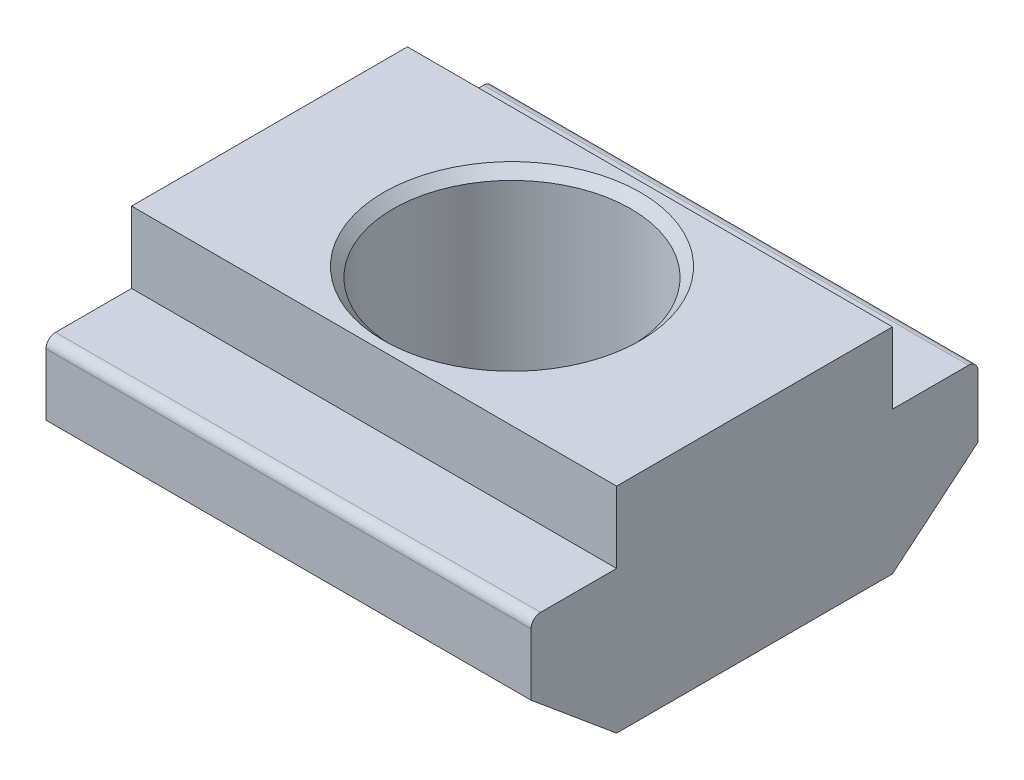
ISO-10303-21;
HEADER;
FILE_DESCRIPTION(('STEP AP214'),'2;1');
FILE_NAME('part.step','',(''),(''),'','','');
FILE_SCHEMA(('AUTOMOTIVE_DESIGN { 1 0 10303 214 1 1 1 1 }'));
ENDSEC;
DATA;
#1=APPLICATION_CONTEXT('core data for automotive mechanical design processes');
#2=APPLICATION_PROTOCOL_DEFINITION('international standard','automotive_design',2000,#1);
#3=PRODUCT_CONTEXT('',#1,'mechanical');
#4=PRODUCT('Part','Part','',(#3));
#5=PRODUCT_RELATED_PRODUCT_CATEGORY('part','',(#4));
#6=PRODUCT_DEFINITION_FORMATION('','',#4);
#7=PRODUCT_DEFINITION_CONTEXT('part definition',#1,'design');
#8=PRODUCT_DEFINITION('design','',#6,#7);
#9=PRODUCT_DEFINITION_SHAPE('','',#8);
#10=(LENGTH_UNIT() NAMED_UNIT(*) SI_UNIT(.MILLI.,.METRE.));
#11=(NAMED_UNIT(*) PLANE_ANGLE_UNIT() SI_UNIT($,.RADIAN.));
#12=(NAMED_UNIT(*) SI_UNIT($,.STERADIAN.) SOLID_ANGLE_UNIT());
#13=UNCERTAINTY_MEASURE_WITH_UNIT(LENGTH_MEASURE(1.E-05),#10,'distance_accuracy_value','');
#14=(GEOMETRIC_REPRESENTATION_CONTEXT(3) GLOBAL_UNCERTAINTY_ASSIGNED_CONTEXT((#13)) GLOBAL_UNIT_ASSIGNED_CONTEXT((#10,
#11,#12)) REPRESENTATION_CONTEXT('',''));
#15=CARTESIAN_POINT('',(0.,0.,0.));
#16=DIRECTION('',(0.,0.,1.));
#17=DIRECTION('',(1.,0.,0.));
#18=AXIS2_PLACEMENT_3D('',#15,#16,#17);
#19=CARTESIAN_POINT('',(10.2000000000007,2.33146835171283E-12,2.90000000000065));
#20=DIRECTION('',(0.,0.768221279597362,-0.64018439966451));
#21=DIRECTION('',(0.,0.64018439966446,0.768221279597426));
#22=AXIS2_PLACEMENT_3D('',#19,#20,#21);
#23=PLANE('',#22);
#24=DIRECTION('',(0.,-0.64018439966446,-0.768221279597427));
#25=VECTOR('',#24,1.);
#26=CARTESIAN_POINT('',(9.99200722162641E-13,2.33146835171283E-12,2.90000000000002));
#27=LINE('',#26,#25);
#28=CARTESIAN_POINT('',(5.55111512312578E-13,1.50000000000314,4.70000000000003));
#29=VERTEX_POINT('',#28);
#30=CARTESIAN_POINT('',(9.99200722162641E-13,2.33146835171283E-12,2.90000000000002));
#31=VERTEX_POINT('',#30);
#32=EDGE_CURVE('E148',#29,#31,#27,.T.);
#33=ORIENTED_EDGE('',*,*,#32,.T.);
#34=DIRECTION('',(-1.00000000000002,0.,0.));
#35=VECTOR('',#34,1.);
#36=CARTESIAN_POINT('',(10.2000000000007,2.33146835171283E-12,2.90000000000065));
#37=LINE('',#36,#35);
#38=CARTESIAN_POINT('',(10.2000000000007,2.33146835171283E-12,2.90000000000065));
#39=VERTEX_POINT('',#38);
#40=EDGE_CURVE('E129',#39,#31,#37,.T.);
#41=ORIENTED_EDGE('',*,*,#40,.F.);
#42=DIRECTION('',(0.,-0.64018439966446,-0.768221279597427));
#43=VECTOR('',#42,1.);
#44=CARTESIAN_POINT('',(10.2000000000007,2.33146835171283E-12,2.90000000000065));
#45=LINE('',#44,#43);
#46=CARTESIAN_POINT('',(10.2000000000008,1.50000000000161,4.70000000000061));
#47=VERTEX_POINT('',#46);
#48=EDGE_CURVE('E135',#47,#39,#45,.T.);
#49=ORIENTED_EDGE('',*,*,#48,.F.);
#50=DIRECTION('',(-1.00000000000002,0.,0.));
#51=VECTOR('',#50,1.);
#52=CARTESIAN_POINT('',(10.2000000000008,1.50000000000161,4.70000000000061));
#53=LINE('',#52,#51);
#54=EDGE_CURVE('E203',#47,#29,#53,.T.);
#55=ORIENTED_EDGE('',*,*,#54,.T.);
#56=EDGE_LOOP('',(#33,#41,#49,#55));
#57=FACE_BOUND('',#56,.T.);
#58=ADVANCED_FACE('F36',(#57),#23,.F.);
#59=CARTESIAN_POINT('',(10.2000000000007,2.33146835171283E-12,2.90000000000065));
#60=DIRECTION('',(0.,0.999999999999986,0.));
#61=DIRECTION('',(0.,0.,1.00000000000005));
#62=AXIS2_PLACEMENT_3D('',#59,#60,#61);
#63=PLANE('',#62);
#64=CARTESIAN_POINT('',(5.10000000000012,0.,0.));
#65=DIRECTION('',(0.,0.999999999999986,0.));
#66=DIRECTION('',(0.,0.,1.00000000000005));
#67=AXIS2_PLACEMENT_3D('',#64,#65,#66);
#68=CIRCLE('',#67,2.5);
#69=CARTESIAN_POINT('',(5.10000000000012,0.,2.50000000000022));
#70=VERTEX_POINT('',#69);
#71=EDGE_CURVE('E225',#70,#70,#68,.T.);
#72=ORIENTED_EDGE('',*,*,#71,.T.);
#73=EDGE_LOOP('',(#72));
#74=FACE_BOUND('',#73,.T.);
#75=DIRECTION('',(0.,0.,-1.00000000000005));
#76=VECTOR('',#75,1.);
#77=CARTESIAN_POINT('',(9.99200722162641E-13,2.33146835171283E-12,2.90000000000002));
#78=LINE('',#77,#76);
#79=CARTESIAN_POINT('',(0.,2.33146835171283E-12,-2.89999999999997));
#80=VERTEX_POINT('',#79);
#81=EDGE_CURVE('E221',#31,#80,#78,.T.);
#82=ORIENTED_EDGE('',*,*,#81,.T.);
#83=DIRECTION('',(-1.00000000000002,0.,0.));
#84=VECTOR('',#83,1.);
#85=CARTESIAN_POINT('',(10.2000000000001,2.41473507855972E-12,-2.9));
#86=LINE('',#85,#84);
#87=CARTESIAN_POINT('',(10.2000000000001,2.41473507855972E-12,-2.9));
#88=VERTEX_POINT('',#87);
#89=EDGE_CURVE('E132',#88,#80,#86,.T.);
#90=ORIENTED_EDGE('',*,*,#89,.F.);
#91=DIRECTION('',(0.,0.,-1.00000000000005));
#92=VECTOR('',#91,1.);
#93=CARTESIAN_POINT('',(10.2000000000007,2.33146835171283E-12,2.90000000000065));
#94=LINE('',#93,#92);
#95=EDGE_CURVE('E125',#39,#88,#94,.T.);
#96=ORIENTED_EDGE('',*,*,#95,.F.);
#97=ORIENTED_EDGE('',*,*,#40,.T.);
#98=EDGE_LOOP('',(#82,#90,#96,#97));
#99=FACE_BOUND('',#98,.T.);
#100=ADVANCED_FACE('F127',(#74,#99),#63,.F.);
#101=CARTESIAN_POINT('',(10.1999999999995,1.5,-4.70000000000007));
#102=DIRECTION('',(0.,0.768221279597362,0.640184399664494));
#103=DIRECTION('',(0.,-0.640184399664471,0.768221279597428));
#104=AXIS2_PLACEMENT_3D('',#101,#102,#103);
#105=PLANE('',#104);
#106=DIRECTION('',(0.,0.640184399664471,-0.768221279597428));
#107=VECTOR('',#106,1.);
#108=CARTESIAN_POINT('',(-5.41233724504764E-13,1.5,-4.7000000000002));
#109=LINE('',#108,#107);
#110=CARTESIAN_POINT('',(-5.41233724504764E-13,1.5,-4.7000000000002));
#111=VERTEX_POINT('',#110);
#112=EDGE_CURVE('E192',#80,#111,#109,.T.);
#113=ORIENTED_EDGE('',*,*,#112,.T.);
#114=DIRECTION('',(-1.00000000000002,0.,0.));
#115=VECTOR('',#114,1.);
#116=CARTESIAN_POINT('',(10.1999999999995,1.5,-4.70000000000007));
#117=LINE('',#116,#115);
#118=CARTESIAN_POINT('',(10.1999999999995,1.5,-4.70000000000007));
#119=VERTEX_POINT('',#118);
#120=EDGE_CURVE('E154',#119,#111,#117,.T.);
#121=ORIENTED_EDGE('',*,*,#120,.F.);
#122=DIRECTION('',(0.,0.640184399664471,-0.768221279597428));
#123=VECTOR('',#122,1.);
#124=CARTESIAN_POINT('',(10.1999999999995,1.5,-4.70000000000007));
#125=LINE('',#124,#123);
#126=EDGE_CURVE('E134',#88,#119,#125,.T.);
#127=ORIENTED_EDGE('',*,*,#126,.F.);
#128=ORIENTED_EDGE('',*,*,#89,.T.);
#129=EDGE_LOOP('',(#113,#121,#127,#128));
#130=FACE_BOUND('',#129,.T.);
#131=ADVANCED_FACE('F261',(#130),#105,.F.);
#132=CARTESIAN_POINT('',(10.1999999999991,3.,-4.69999999999962));
#133=DIRECTION('',(0.,0.,1.00000000000005));
#134=DIRECTION('',(1.00000000000002,0.,0.));
#135=AXIS2_PLACEMENT_3D('',#132,#133,#134);
#136=PLANE('',#135);
#137=DIRECTION('',(0.,0.999999999999986,0.));
#138=VECTOR('',#137,1.);
#139=CARTESIAN_POINT('',(-5.41233724504764E-13,3.,-4.70000000000012));
#140=LINE('',#139,#138);
#141=CARTESIAN_POINT('',(-6.52256026967279E-13,2.80000000000002,-4.70000000000026));
#142=VERTEX_POINT('',#141);
#143=EDGE_CURVE('E188',#111,#142,#140,.T.);
#144=ORIENTED_EDGE('',*,*,#143,.T.);
#145=DIRECTION('',(-1.00000000000002,0.,0.));
#146=VECTOR('',#145,1.);
#147=CARTESIAN_POINT('',(10.1999999999992,2.80000000000002,-4.69999999999952));
#148=LINE('',#147,#146);
#149=CARTESIAN_POINT('',(10.1999999999992,2.80000000000002,-4.69999999999952));
#150=VERTEX_POINT('',#149);
#151=EDGE_CURVE('E11',#142,#150,#148,.F.);
#152=ORIENTED_EDGE('',*,*,#151,.T.);
#153=DIRECTION('',(0.,0.999999999999986,0.));
#154=VECTOR('',#153,1.);
#155=CARTESIAN_POINT('',(10.1999999999991,3.,-4.69999999999962));
#156=LINE('',#155,#154);
#157=EDGE_CURVE('E218',#119,#150,#156,.T.);
#158=ORIENTED_EDGE('',*,*,#157,.F.);
#159=ORIENTED_EDGE('',*,*,#120,.T.);
#160=EDGE_LOOP('',(#144,#152,#158,#159));
#161=FACE_BOUND('',#160,.T.);
#162=ADVANCED_FACE('F217',(#161),#136,.F.);
#163=CARTESIAN_POINT('',(10.2000000000002,3.00000000000236,-2.89999999999945));
#164=DIRECTION('',(0.,-0.999999999999986,0.));
#165=DIRECTION('',(0.,0.,-1.00000000000005));
#166=AXIS2_PLACEMENT_3D('',#163,#164,#165);
#167=PLANE('',#166);
#168=DIRECTION('',(0.,0.,1.00000000000005));
#169=VECTOR('',#168,1.);
#170=CARTESIAN_POINT('',(10.2000000000002,3.00000000000236,-2.89999999999945));
#171=LINE('',#170,#169);
#172=CARTESIAN_POINT('',(10.1999999999995,3.,-4.50000000000007));
#173=VERTEX_POINT('',#172);
#174=CARTESIAN_POINT('',(10.2000000000002,3.00000000000236,-2.89999999999945));
#175=VERTEX_POINT('',#174);
#176=EDGE_CURVE('E179',#173,#175,#171,.T.);
#177=ORIENTED_EDGE('',*,*,#176,.F.);
#178=DIRECTION('',(-1.00000000000002,0.,0.));
#179=VECTOR('',#178,1.);
#180=CARTESIAN_POINT('',(10.1999999999995,3.,-4.50000000000007));
#181=LINE('',#180,#179);
#182=CARTESIAN_POINT('',(-5.55111512312578E-13,3.,-4.50000000000012));
#183=VERTEX_POINT('',#182);
#184=EDGE_CURVE('E44',#173,#183,#181,.T.);
#185=ORIENTED_EDGE('',*,*,#184,.T.);
#186=DIRECTION('',(0.,0.,1.00000000000005));
#187=VECTOR('',#186,1.);
#188=CARTESIAN_POINT('',(-2.63677968348475E-13,3.00000000000233,-2.90000000000006));
#189=LINE('',#188,#187);
#190=CARTESIAN_POINT('',(-2.63677968348475E-13,3.00000000000233,-2.90000000000006));
#191=VERTEX_POINT('',#190);
#192=EDGE_CURVE('E177',#183,#191,#189,.T.);
#193=ORIENTED_EDGE('',*,*,#192,.T.);
#194=DIRECTION('',(-1.00000000000002,0.,0.));
#195=VECTOR('',#194,1.);
#196=CARTESIAN_POINT('',(10.2000000000002,3.00000000000236,-2.89999999999945));
#197=LINE('',#196,#195);
#198=EDGE_CURVE('E214',#175,#191,#197,.T.);
#199=ORIENTED_EDGE('',*,*,#198,.F.);
#200=EDGE_LOOP('',(#177,#185,#193,#199));
#201=FACE_BOUND('',#200,.T.);
#202=ADVANCED_FACE('F175',(#201),#167,.F.);
#203=CARTESIAN_POINT('',(10.2000000000003,4.50000000000236,-2.89999999999944));
#204=DIRECTION('',(0.,0.,1.00000000000005));
#205=DIRECTION('',(1.00000000000002,0.,0.));
#206=AXIS2_PLACEMENT_3D('',#203,#204,#205);
#207=PLANE('',#206);
#208=DIRECTION('',(0.,0.999999999999986,0.));
#209=VECTOR('',#208,1.);
#210=CARTESIAN_POINT('',(2.22044604925031E-13,4.50000000000228,-2.90000000000033));
#211=LINE('',#210,#209);
#212=CARTESIAN_POINT('',(2.22044604925031E-13,4.50000000000228,-2.90000000000033));
#213=VERTEX_POINT('',#212);
#214=EDGE_CURVE('E187',#191,#213,#211,.T.);
#215=ORIENTED_EDGE('',*,*,#214,.T.);
#216=DIRECTION('',(-1.00000000000002,0.,0.));
#217=VECTOR('',#216,1.);
#218=CARTESIAN_POINT('',(10.2000000000003,4.50000000000236,-2.89999999999944));
#219=LINE('',#218,#217);
#220=CARTESIAN_POINT('',(10.2000000000003,4.50000000000236,-2.89999999999944));
#221=VERTEX_POINT('',#220);
#222=EDGE_CURVE('E211',#221,#213,#219,.T.);
#223=ORIENTED_EDGE('',*,*,#222,.F.);
#224=DIRECTION('',(0.,0.999999999999986,0.));
#225=VECTOR('',#224,1.);
#226=CARTESIAN_POINT('',(10.2000000000003,4.50000000000236,-2.89999999999944));
#227=LINE('',#226,#225);
#228=EDGE_CURVE('E233',#175,#221,#227,.T.);
#229=ORIENTED_EDGE('',*,*,#228,.F.);
#230=ORIENTED_EDGE('',*,*,#198,.T.);
#231=EDGE_LOOP('',(#215,#223,#229,#230));
#232=FACE_BOUND('',#231,.T.);
#233=ADVANCED_FACE('F290',(#232),#207,.F.);
#234=CARTESIAN_POINT('',(10.2000000000017,4.50000000000234,2.90000000000073));
#235=DIRECTION('',(0.,-0.999999999999986,0.));
#236=DIRECTION('',(0.,0.,-1.00000000000005));
#237=AXIS2_PLACEMENT_3D('',#234,#235,#236);
#238=PLANE('',#237);
#239=CARTESIAN_POINT('',(5.10000000000062,4.5,0.));
#240=DIRECTION('',(0.,-0.999999999999986,0.));
#241=DIRECTION('',(0.,0.,-1.00000000000005));
#242=AXIS2_PLACEMENT_3D('',#239,#240,#241);
#243=CIRCLE('',#242,2.7);
#244=CARTESIAN_POINT('',(5.10000000000062,4.50000000000001,-2.70000000000006));
#245=VERTEX_POINT('',#244);
#246=EDGE_CURVE('E152',#245,#245,#243,.T.);
#247=ORIENTED_EDGE('',*,*,#246,.T.);
#248=EDGE_LOOP('',(#247));
#249=FACE_BOUND('',#248,.T.);
#250=DIRECTION('',(0.,0.,1.00000000000005));
#251=VECTOR('',#250,1.);
#252=CARTESIAN_POINT('',(1.16573417585641E-12,4.50000000000234,2.89999999999986));
#253=LINE('',#252,#251);
#254=CARTESIAN_POINT('',(1.16573417585641E-12,4.50000000000234,2.89999999999986));
#255=VERTEX_POINT('',#254);
#256=EDGE_CURVE('E190',#213,#255,#253,.T.);
#257=ORIENTED_EDGE('',*,*,#256,.T.);
#258=DIRECTION('',(-1.00000000000002,0.,0.));
#259=VECTOR('',#258,1.);
#260=CARTESIAN_POINT('',(10.2000000000017,4.50000000000234,2.90000000000073));
#261=LINE('',#260,#259);
#262=CARTESIAN_POINT('',(10.2000000000017,4.50000000000234,2.90000000000073));
#263=VERTEX_POINT('',#262);
#264=EDGE_CURVE('E208',#263,#255,#261,.T.);
#265=ORIENTED_EDGE('',*,*,#264,.F.);
#266=DIRECTION('',(0.,0.,1.00000000000005));
#267=VECTOR('',#266,1.);
#268=CARTESIAN_POINT('',(10.2000000000017,4.50000000000234,2.90000000000073));
#269=LINE('',#268,#267);
#270=EDGE_CURVE('E231',#221,#263,#269,.T.);
#271=ORIENTED_EDGE('',*,*,#270,.F.);
#272=ORIENTED_EDGE('',*,*,#222,.T.);
#273=EDGE_LOOP('',(#257,#265,#271,#272));
#274=FACE_BOUND('',#273,.T.);
#275=ADVANCED_FACE('F285',(#249,#274),#238,.F.);
#276=CARTESIAN_POINT('',(10.2000000000011,3.00000000000227,2.90000000000053));
#277=DIRECTION('',(0.,0.,-1.00000000000005));
#278=DIRECTION('',(-1.00000000000002,0.,0.));
#279=AXIS2_PLACEMENT_3D('',#276,#277,#278);
#280=PLANE('',#279);
#281=DIRECTION('',(0.,-0.999999999999986,0.));
#282=VECTOR('',#281,1.);
#283=CARTESIAN_POINT('',(9.43689570931383E-13,3.00000000000234,2.89999999999991));
#284=LINE('',#283,#282);
#285=CARTESIAN_POINT('',(9.43689570931383E-13,3.00000000000234,2.89999999999991));
#286=VERTEX_POINT('',#285);
#287=EDGE_CURVE('E197',#255,#286,#284,.T.);
#288=ORIENTED_EDGE('',*,*,#287,.T.);
#289=DIRECTION('',(-1.00000000000002,0.,0.));
#290=VECTOR('',#289,1.);
#291=CARTESIAN_POINT('',(10.2000000000011,3.00000000000227,2.90000000000053));
#292=LINE('',#291,#290);
#293=CARTESIAN_POINT('',(10.2000000000011,3.00000000000227,2.90000000000053));
#294=VERTEX_POINT('',#293);
#295=EDGE_CURVE('E205',#294,#286,#292,.T.);
#296=ORIENTED_EDGE('',*,*,#295,.F.);
#297=DIRECTION('',(0.,-0.999999999999986,0.));
#298=VECTOR('',#297,1.);
#299=CARTESIAN_POINT('',(10.2000000000011,3.00000000000227,2.90000000000053));
#300=LINE('',#299,#298);
#301=EDGE_CURVE('E229',#263,#294,#300,.T.);
#302=ORIENTED_EDGE('',*,*,#301,.F.);
#303=ORIENTED_EDGE('',*,*,#264,.T.);
#304=EDGE_LOOP('',(#288,#296,#302,#303));
#305=FACE_BOUND('',#304,.T.);
#306=ADVANCED_FACE('F282',(#305),#280,.F.);
#307=CARTESIAN_POINT('',(10.200000000001,3.00000000000156,4.70000000000065));
#308=DIRECTION('',(0.,-0.999999999999986,0.));
#309=DIRECTION('',(0.,0.,-1.00000000000005));
#310=AXIS2_PLACEMENT_3D('',#307,#308,#309);
#311=PLANE('',#310);
#312=DIRECTION('',(0.,0.,1.00000000000005));
#313=VECTOR('',#312,1.);
#314=CARTESIAN_POINT('',(6.10622663543836E-13,3.0000000000032,4.70000000000006));
#315=LINE('',#314,#313);
#316=CARTESIAN_POINT('',(5.55111512312578E-13,3.00000000000314,4.49999999999984));
#317=VERTEX_POINT('',#316);
#318=EDGE_CURVE('E199',#286,#317,#315,.T.);
#319=ORIENTED_EDGE('',*,*,#318,.T.);
#320=DIRECTION('',(-1.00000000000002,0.,0.));
#321=VECTOR('',#320,1.);
#322=CARTESIAN_POINT('',(10.2000000000009,3.00000000000155,4.50000000000062));
#323=LINE('',#322,#321);
#324=CARTESIAN_POINT('',(10.2000000000009,3.00000000000155,4.50000000000062));
#325=VERTEX_POINT('',#324);
#326=EDGE_CURVE('E167',#317,#325,#323,.F.);
#327=ORIENTED_EDGE('',*,*,#326,.T.);
#328=DIRECTION('',(0.,0.,1.00000000000005));
#329=VECTOR('',#328,1.);
#330=CARTESIAN_POINT('',(10.200000000001,3.00000000000156,4.70000000000065));
#331=LINE('',#330,#329);
#332=EDGE_CURVE('E227',#294,#325,#331,.T.);
#333=ORIENTED_EDGE('',*,*,#332,.F.);
#334=ORIENTED_EDGE('',*,*,#295,.T.);
#335=EDGE_LOOP('',(#319,#327,#333,#334));
#336=FACE_BOUND('',#335,.T.);
#337=ADVANCED_FACE('F278',(#336),#311,.F.);
#338=CARTESIAN_POINT('',(10.2000000000008,1.50000000000161,4.70000000000061));
#339=DIRECTION('',(0.,0.,-1.00000000000005));
#340=DIRECTION('',(-1.00000000000002,0.,0.));
#341=AXIS2_PLACEMENT_3D('',#338,#339,#340);
#342=PLANE('',#341);
#343=DIRECTION('',(0.,-0.999999999999986,0.));
#344=VECTOR('',#343,1.);
#345=CARTESIAN_POINT('',(10.2000000000008,1.50000000000161,4.70000000000061));
#346=LINE('',#345,#344);
#347=CARTESIAN_POINT('',(10.2000000000009,2.80000000000158,4.70000000000071));
#348=VERTEX_POINT('',#347);
#349=EDGE_CURVE('E141',#348,#47,#346,.T.);
#350=ORIENTED_EDGE('',*,*,#349,.F.);
#351=DIRECTION('',(-1.00000000000002,0.,0.));
#352=VECTOR('',#351,1.);
#353=CARTESIAN_POINT('',(10.2000000000009,2.80000000000158,4.70000000000071));
#354=LINE('',#353,#352);
#355=CARTESIAN_POINT('',(4.44089209850063E-13,2.80000000000311,4.70000000000015));
#356=VERTEX_POINT('',#355);
#357=EDGE_CURVE('E160',#348,#356,#354,.T.);
#358=ORIENTED_EDGE('',*,*,#357,.T.);
#359=DIRECTION('',(0.,-0.999999999999986,0.));
#360=VECTOR('',#359,1.);
#361=CARTESIAN_POINT('',(5.55111512312578E-13,1.50000000000314,4.70000000000003));
#362=LINE('',#361,#360);
#363=EDGE_CURVE('E145',#356,#29,#362,.T.);
#364=ORIENTED_EDGE('',*,*,#363,.T.);
#365=ORIENTED_EDGE('',*,*,#54,.F.);
#366=EDGE_LOOP('',(#350,#358,#364,#365));
#367=FACE_BOUND('',#366,.T.);
#368=ADVANCED_FACE('F274',(#367),#342,.F.);
#369=CARTESIAN_POINT('',(10.2,2.24820162486594E-12,0.));
#370=DIRECTION('',(1.00000000000002,0.,0.));
#371=DIRECTION('',(0.,0.,-1.00000000000005));
#372=AXIS2_PLACEMENT_3D('',#369,#370,#371);
#373=PLANE('',#372);
#374=ORIENTED_EDGE('',*,*,#332,.T.);
#375=CARTESIAN_POINT('',(10.2000000000009,2.80000000000158,4.50000000000068));
#376=DIRECTION('',(1.00000000000002,0.,0.));
#377=DIRECTION('',(0.,0.,-1.00000000000005));
#378=AXIS2_PLACEMENT_3D('',#375,#376,#377);
#379=CIRCLE('',#378,0.2);
#380=EDGE_CURVE('E170',#325,#348,#379,.T.);
#381=ORIENTED_EDGE('',*,*,#380,.T.);
#382=ORIENTED_EDGE('',*,*,#349,.T.);
#383=ORIENTED_EDGE('',*,*,#48,.T.);
#384=ORIENTED_EDGE('',*,*,#95,.T.);
#385=ORIENTED_EDGE('',*,*,#126,.T.);
#386=ORIENTED_EDGE('',*,*,#157,.T.);
#387=CARTESIAN_POINT('',(10.1999999999995,2.80000000000002,-4.50000000000005));
#388=DIRECTION('',(1.00000000000002,0.,0.));
#389=DIRECTION('',(0.,0.,-1.00000000000005));
#390=AXIS2_PLACEMENT_3D('',#387,#388,#389);
#391=CIRCLE('',#390,0.2);
#392=EDGE_CURVE('E51',#150,#173,#391,.T.);
#393=ORIENTED_EDGE('',*,*,#392,.T.);
#394=ORIENTED_EDGE('',*,*,#176,.T.);
#395=ORIENTED_EDGE('',*,*,#228,.T.);
#396=ORIENTED_EDGE('',*,*,#270,.T.);
#397=ORIENTED_EDGE('',*,*,#301,.T.);
#398=EDGE_LOOP('',(#374,#381,#382,#383,#384,#385,#386,#393,#394,#395,#396,#397));
#399=FACE_BOUND('',#398,.T.);
#400=ADVANCED_FACE('F139',(#399),#373,.T.);
#401=CARTESIAN_POINT('',(0.,0.,0.));
#402=DIRECTION('',(1.00000000000002,0.,0.));
#403=DIRECTION('',(0.,0.,-1.00000000000005));
#404=AXIS2_PLACEMENT_3D('',#401,#402,#403);
#405=PLANE('',#404);
#406=ORIENTED_EDGE('',*,*,#363,.F.);
#407=CARTESIAN_POINT('',(4.9960036108132E-13,2.80000000000311,4.49999999999993));
#408=DIRECTION('',(1.00000000000002,0.,0.));
#409=DIRECTION('',(0.,0.,-1.00000000000005));
#410=AXIS2_PLACEMENT_3D('',#407,#408,#409);
#411=CIRCLE('',#410,0.2);
#412=EDGE_CURVE('E165',#356,#317,#411,.F.);
#413=ORIENTED_EDGE('',*,*,#412,.T.);
#414=ORIENTED_EDGE('',*,*,#318,.F.);
#415=ORIENTED_EDGE('',*,*,#287,.F.);
#416=ORIENTED_EDGE('',*,*,#256,.F.);
#417=ORIENTED_EDGE('',*,*,#214,.F.);
#418=ORIENTED_EDGE('',*,*,#192,.F.);
#419=CARTESIAN_POINT('',(-5.55111512312578E-13,2.80000000000002,-4.50000000000013));
#420=DIRECTION('',(1.00000000000002,0.,0.));
#421=DIRECTION('',(0.,0.,-1.00000000000005));
#422=AXIS2_PLACEMENT_3D('',#419,#420,#421);
#423=CIRCLE('',#422,0.2);
#424=EDGE_CURVE('E163',#183,#142,#423,.F.);
#425=ORIENTED_EDGE('',*,*,#424,.T.);
#426=ORIENTED_EDGE('',*,*,#143,.F.);
#427=ORIENTED_EDGE('',*,*,#112,.F.);
#428=ORIENTED_EDGE('',*,*,#81,.F.);
#429=ORIENTED_EDGE('',*,*,#32,.F.);
#430=EDGE_LOOP('',(#406,#413,#414,#415,#416,#417,#418,#425,#426,#427,#428,#429));
#431=FACE_BOUND('',#430,.T.);
#432=ADVANCED_FACE('F184',(#431),#405,.F.);
#433=CARTESIAN_POINT('',(5.10000000000001,-5.69999999999995,6.17561557447743E-13));
#434=DIRECTION('',(0.,0.999999999999986,0.));
#435=DIRECTION('',(0.,0.,1.00000000000005));
#436=AXIS2_PLACEMENT_3D('',#433,#434,#435);
#437=CYLINDRICAL_SURFACE('',#436,2.5);
#438=CARTESIAN_POINT('',(5.10000000000062,4.29999999999997,5.55111512312578E-13));
#439=DIRECTION('',(0.,-0.999999999999986,0.));
#440=DIRECTION('',(0.,0.,-1.00000000000005));
#441=AXIS2_PLACEMENT_3D('',#438,#439,#440);
#442=CIRCLE('',#441,2.5);
#443=CARTESIAN_POINT('',(5.10000000000062,4.29999999999997,-2.49999999999957));
#444=VERTEX_POINT('',#443);
#445=EDGE_CURVE('E149',#444,#444,#442,.F.);
#446=ORIENTED_EDGE('',*,*,#445,.T.);
#447=EDGE_LOOP('',(#446));
#448=FACE_BOUND('',#447,.T.);
#449=ORIENTED_EDGE('',*,*,#71,.F.);
#450=EDGE_LOOP('',(#449));
#451=FACE_BOUND('',#450,.T.);
#452=ADVANCED_FACE('F242',(#448,#451),#437,.F.);
#453=CARTESIAN_POINT('',(5.10000000000062,4.29999999999997,5.55111512312578E-13));
#454=DIRECTION('',(0.,0.999999999999986,0.));
#455=DIRECTION('',(0.,0.,1.00000000000005));
#456=AXIS2_PLACEMENT_3D('',#453,#454,#455);
#457=CONICAL_SURFACE('',#456,2.5,0.785398163397452);
#458=ORIENTED_EDGE('',*,*,#246,.F.);
#459=EDGE_LOOP('',(#458));
#460=FACE_BOUND('',#459,.T.);
#461=ORIENTED_EDGE('',*,*,#445,.F.);
#462=EDGE_LOOP('',(#461));
#463=FACE_BOUND('',#462,.T.);
#464=ADVANCED_FACE('F244',(#460,#463),#457,.F.);
#465=CARTESIAN_POINT('',(10.2000000000009,2.80000000000158,4.50000000000068));
#466=DIRECTION('',(-1.00000000000002,0.,0.));
#467=DIRECTION('',(0.,0.,1.00000000000005));
#468=AXIS2_PLACEMENT_3D('',#465,#466,#467);
#469=CYLINDRICAL_SURFACE('',#468,0.2);
#470=ORIENTED_EDGE('',*,*,#380,.F.);
#471=ORIENTED_EDGE('',*,*,#326,.F.);
#472=ORIENTED_EDGE('',*,*,#412,.F.);
#473=ORIENTED_EDGE('',*,*,#357,.F.);
#474=EDGE_LOOP('',(#470,#471,#472,#473));
#475=FACE_BOUND('',#474,.T.);
#476=ADVANCED_FACE('F251',(#475),#469,.T.);
#477=CARTESIAN_POINT('',(10.1999999999995,2.80000000000002,-4.50000000000005));
#478=DIRECTION('',(-1.00000000000002,0.,0.));
#479=DIRECTION('',(0.,0.,1.00000000000005));
#480=AXIS2_PLACEMENT_3D('',#477,#478,#479);
#481=CYLINDRICAL_SURFACE('',#480,0.2);
#482=ORIENTED_EDGE('',*,*,#392,.F.);
#483=ORIENTED_EDGE('',*,*,#151,.F.);
#484=ORIENTED_EDGE('',*,*,#424,.F.);
#485=ORIENTED_EDGE('',*,*,#184,.F.);
#486=EDGE_LOOP('',(#482,#483,#484,#485));
#487=FACE_BOUND('',#486,.T.);
#488=ADVANCED_FACE('F38',(#487),#481,.T.);
#489=CLOSED_SHELL('',(#58,#100,#131,#162,#202,#233,#275,#306,#337,#368,#400,#432,#452,#464,#476,#488));
#490=MANIFOLD_SOLID_BREP('B2',#489);
#491=ADVANCED_BREP_SHAPE_REPRESENTATION('',(#18,#490),#14);
#492=SHAPE_DEFINITION_REPRESENTATION(#9,#491);
ENDSEC;
END-ISO-10303-21;
